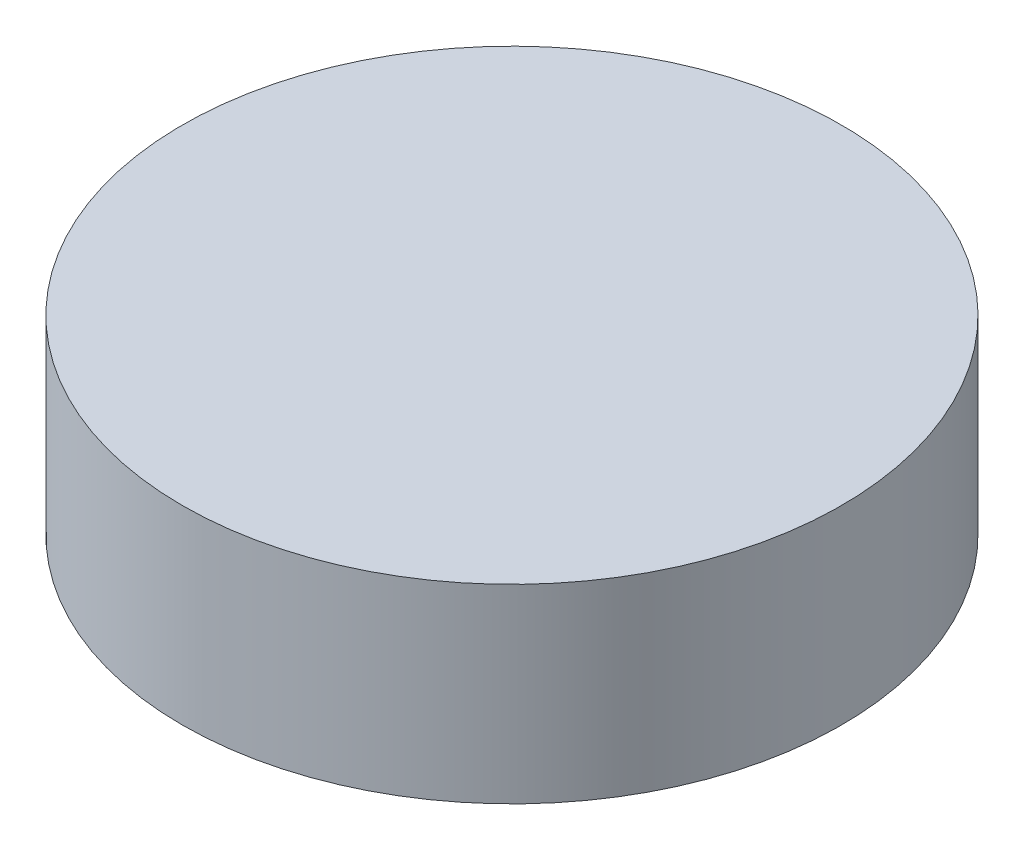
ISO-10303-21;
HEADER;
FILE_DESCRIPTION(('STEP AP214'),'2;1');
FILE_NAME('part.step','',(''),(''),'','','');
FILE_SCHEMA(('AUTOMOTIVE_DESIGN { 1 0 10303 214 1 1 1 1 }'));
ENDSEC;
DATA;
#1=APPLICATION_CONTEXT('core data for automotive mechanical design processes');
#2=APPLICATION_PROTOCOL_DEFINITION('international standard','automotive_design',2000,#1);
#3=PRODUCT_CONTEXT('',#1,'mechanical');
#4=PRODUCT('Part','Part','',(#3));
#5=PRODUCT_RELATED_PRODUCT_CATEGORY('part','',(#4));
#6=PRODUCT_DEFINITION_FORMATION('','',#4);
#7=PRODUCT_DEFINITION_CONTEXT('part definition',#1,'design');
#8=PRODUCT_DEFINITION('design','',#6,#7);
#9=PRODUCT_DEFINITION_SHAPE('','',#8);
#10=(LENGTH_UNIT() NAMED_UNIT(*) SI_UNIT(.MILLI.,.METRE.));
#11=(NAMED_UNIT(*) PLANE_ANGLE_UNIT() SI_UNIT($,.RADIAN.));
#12=(NAMED_UNIT(*) SI_UNIT($,.STERADIAN.) SOLID_ANGLE_UNIT());
#13=UNCERTAINTY_MEASURE_WITH_UNIT(LENGTH_MEASURE(1.E-05),#10,'distance_accuracy_value','');
#14=(GEOMETRIC_REPRESENTATION_CONTEXT(3) GLOBAL_UNCERTAINTY_ASSIGNED_CONTEXT((#13)) GLOBAL_UNIT_ASSIGNED_CONTEXT((#10,
#11,#12)) REPRESENTATION_CONTEXT('',''));
#15=CARTESIAN_POINT('',(0.,0.,0.));
#16=DIRECTION('',(0.,0.,1.));
#17=DIRECTION('',(1.,0.,0.));
#18=AXIS2_PLACEMENT_3D('',#15,#16,#17);
#19=CARTESIAN_POINT('',(0.,7.5,0.));
#20=DIRECTION('',(0.,-1.,0.));
#21=DIRECTION('',(0.,0.,-1.));
#22=AXIS2_PLACEMENT_3D('',#19,#20,#21);
#23=CYLINDRICAL_SURFACE('',#22,13.);
#24=CARTESIAN_POINT('',(0.,7.5,0.));
#25=DIRECTION('',(0.,1.,0.));
#26=DIRECTION('',(0.,0.,1.));
#27=AXIS2_PLACEMENT_3D('',#24,#25,#26);
#28=CIRCLE('',#27,13.);
#29=CARTESIAN_POINT('',(0.,7.5,13.));
#30=VERTEX_POINT('',#29);
#31=EDGE_CURVE('E10',#30,#30,#28,.T.);
#32=ORIENTED_EDGE('',*,*,#31,.F.);
#33=EDGE_LOOP('',(#32));
#34=FACE_BOUND('',#33,.T.);
#35=CARTESIAN_POINT('',(0.,0.,0.));
#36=DIRECTION('',(0.,1.,0.));
#37=DIRECTION('',(0.,0.,1.));
#38=AXIS2_PLACEMENT_3D('',#35,#36,#37);
#39=CIRCLE('',#38,13.);
#40=CARTESIAN_POINT('',(0.,0.,13.));
#41=VERTEX_POINT('',#40);
#42=EDGE_CURVE('E35',#41,#41,#39,.T.);
#43=ORIENTED_EDGE('',*,*,#42,.T.);
#44=EDGE_LOOP('',(#43));
#45=FACE_BOUND('',#44,.T.);
#46=ADVANCED_FACE('F32',(#34,#45),#23,.T.);
#47=CARTESIAN_POINT('',(0.,7.5,0.));
#48=DIRECTION('',(0.,1.,0.));
#49=DIRECTION('',(0.,0.,1.));
#50=AXIS2_PLACEMENT_3D('',#47,#48,#49);
#51=PLANE('',#50);
#52=ORIENTED_EDGE('',*,*,#31,.T.);
#53=EDGE_LOOP('',(#52));
#54=FACE_BOUND('',#53,.T.);
#55=ADVANCED_FACE('F47',(#54),#51,.T.);
#56=CARTESIAN_POINT('',(0.,0.,0.));
#57=DIRECTION('',(0.,1.,0.));
#58=DIRECTION('',(0.,0.,1.));
#59=AXIS2_PLACEMENT_3D('',#56,#57,#58);
#60=PLANE('',#59);
#61=ORIENTED_EDGE('',*,*,#42,.F.);
#62=EDGE_LOOP('',(#61));
#63=FACE_BOUND('',#62,.T.);
#64=ADVANCED_FACE('F45',(#63),#60,.F.);
#65=CLOSED_SHELL('',(#46,#55,#64));
#66=MANIFOLD_SOLID_BREP('B2',#65);
#67=ADVANCED_BREP_SHAPE_REPRESENTATION('',(#18,#66),#14);
#68=SHAPE_DEFINITION_REPRESENTATION(#9,#67);
ENDSEC;
END-ISO-10303-21;
